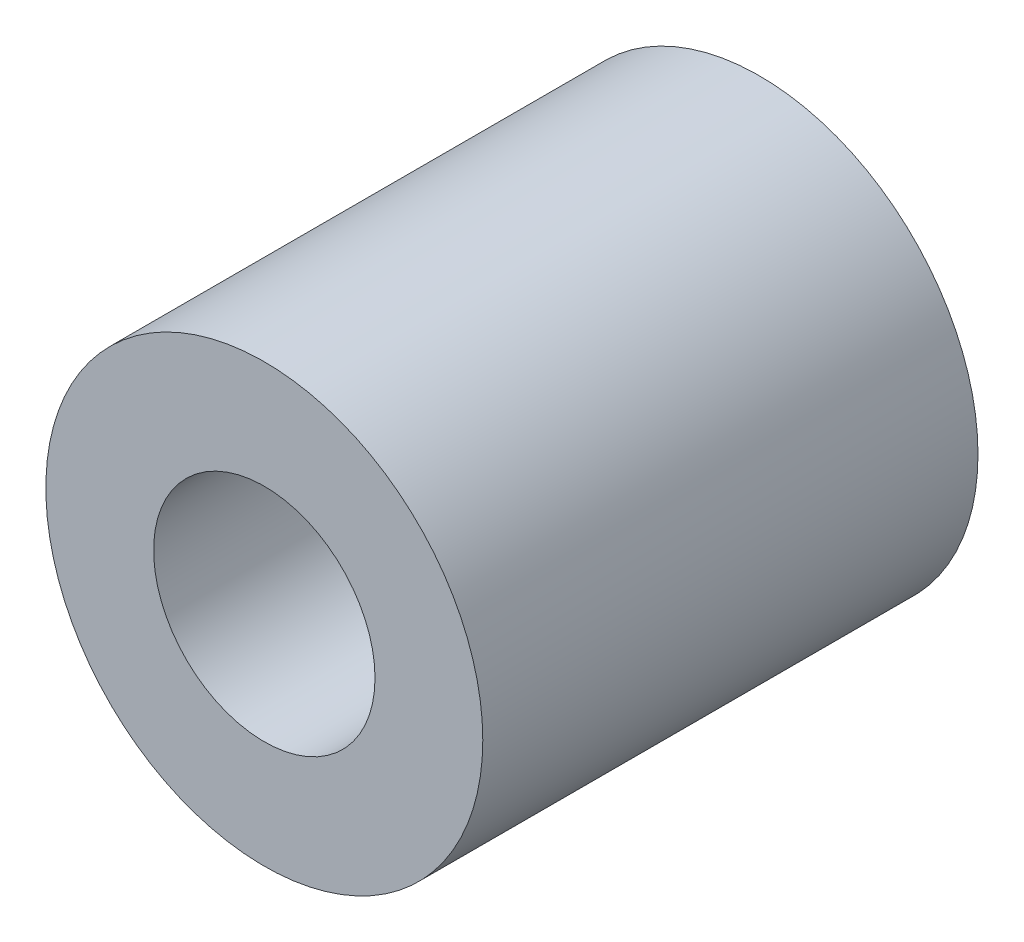
ISO-10303-21;
HEADER;
FILE_DESCRIPTION(('STEP AP214'),'2;1');
FILE_NAME('part.step','',(''),(''),'','','');
FILE_SCHEMA(('AUTOMOTIVE_DESIGN { 1 0 10303 214 1 1 1 1 }'));
ENDSEC;
DATA;
#1=APPLICATION_CONTEXT('core data for automotive mechanical design processes');
#2=APPLICATION_PROTOCOL_DEFINITION('international standard','automotive_design',2000,#1);
#3=PRODUCT_CONTEXT('',#1,'mechanical');
#4=PRODUCT('Part','Part','',(#3));
#5=PRODUCT_RELATED_PRODUCT_CATEGORY('part','',(#4));
#6=PRODUCT_DEFINITION_FORMATION('','',#4);
#7=PRODUCT_DEFINITION_CONTEXT('part definition',#1,'design');
#8=PRODUCT_DEFINITION('design','',#6,#7);
#9=PRODUCT_DEFINITION_SHAPE('','',#8);
#10=(LENGTH_UNIT() NAMED_UNIT(*) SI_UNIT(.MILLI.,.METRE.));
#11=(NAMED_UNIT(*) PLANE_ANGLE_UNIT() SI_UNIT($,.RADIAN.));
#12=(NAMED_UNIT(*) SI_UNIT($,.STERADIAN.) SOLID_ANGLE_UNIT());
#13=UNCERTAINTY_MEASURE_WITH_UNIT(LENGTH_MEASURE(1.E-05),#10,'distance_accuracy_value','');
#14=(GEOMETRIC_REPRESENTATION_CONTEXT(3) GLOBAL_UNCERTAINTY_ASSIGNED_CONTEXT((#13)) GLOBAL_UNIT_ASSIGNED_CONTEXT((#10,
#11,#12)) REPRESENTATION_CONTEXT('',''));
#15=CARTESIAN_POINT('',(0.,0.,0.));
#16=DIRECTION('',(0.,0.,1.));
#17=DIRECTION('',(1.,0.,0.));
#18=AXIS2_PLACEMENT_3D('',#15,#16,#17);
#19=CARTESIAN_POINT('',(0.,0.,21.59));
#20=DIRECTION('',(0.,0.,1.));
#21=DIRECTION('',(1.,0.,0.));
#22=AXIS2_PLACEMENT_3D('',#19,#20,#21);
#23=PLANE('',#22);
#24=CARTESIAN_POINT('',(0.,0.,21.59));
#25=DIRECTION('',(0.,0.,1.));
#26=DIRECTION('',(1.,0.,0.));
#27=AXIS2_PLACEMENT_3D('',#24,#25,#26);
#28=CIRCLE('',#27,9.525);
#29=CARTESIAN_POINT('',(9.525,0.,21.59));
#30=VERTEX_POINT('',#29);
#31=EDGE_CURVE('E10',#30,#30,#28,.T.);
#32=ORIENTED_EDGE('',*,*,#31,.T.);
#33=EDGE_LOOP('',(#32));
#34=FACE_BOUND('',#33,.T.);
#35=CARTESIAN_POINT('',(0.,0.,21.59));
#36=DIRECTION('',(0.,0.,1.));
#37=DIRECTION('',(1.,0.,0.));
#38=AXIS2_PLACEMENT_3D('',#35,#36,#37);
#39=CIRCLE('',#38,4.826);
#40=CARTESIAN_POINT('',(4.826,0.,21.59));
#41=VERTEX_POINT('',#40);
#42=EDGE_CURVE('E41',#41,#41,#39,.T.);
#43=ORIENTED_EDGE('',*,*,#42,.F.);
#44=EDGE_LOOP('',(#43));
#45=FACE_BOUND('',#44,.T.);
#46=ADVANCED_FACE('F30',(#34,#45),#23,.T.);
#47=CARTESIAN_POINT('',(0.,0.,0.));
#48=DIRECTION('',(0.,0.,1.));
#49=DIRECTION('',(1.,0.,0.));
#50=AXIS2_PLACEMENT_3D('',#47,#48,#49);
#51=PLANE('',#50);
#52=CARTESIAN_POINT('',(0.,0.,0.));
#53=DIRECTION('',(0.,0.,1.));
#54=DIRECTION('',(1.,0.,0.));
#55=AXIS2_PLACEMENT_3D('',#52,#53,#54);
#56=CIRCLE('',#55,9.525);
#57=CARTESIAN_POINT('',(9.525,0.,0.));
#58=VERTEX_POINT('',#57);
#59=EDGE_CURVE('E34',#58,#58,#56,.T.);
#60=ORIENTED_EDGE('',*,*,#59,.F.);
#61=EDGE_LOOP('',(#60));
#62=FACE_BOUND('',#61,.T.);
#63=CARTESIAN_POINT('',(0.,0.,0.));
#64=DIRECTION('',(0.,0.,1.));
#65=DIRECTION('',(1.,0.,0.));
#66=AXIS2_PLACEMENT_3D('',#63,#64,#65);
#67=CIRCLE('',#66,4.826);
#68=CARTESIAN_POINT('',(4.826,0.,0.));
#69=VERTEX_POINT('',#68);
#70=EDGE_CURVE('E43',#69,#69,#67,.T.);
#71=ORIENTED_EDGE('',*,*,#70,.T.);
#72=EDGE_LOOP('',(#71));
#73=FACE_BOUND('',#72,.T.);
#74=ADVANCED_FACE('F53',(#62,#73),#51,.F.);
#75=CARTESIAN_POINT('',(0.,0.,21.59));
#76=DIRECTION('',(0.,0.,-1.));
#77=DIRECTION('',(-1.,0.,0.));
#78=AXIS2_PLACEMENT_3D('',#75,#76,#77);
#79=CYLINDRICAL_SURFACE('',#78,9.525);
#80=ORIENTED_EDGE('',*,*,#31,.F.);
#81=EDGE_LOOP('',(#80));
#82=FACE_BOUND('',#81,.T.);
#83=ORIENTED_EDGE('',*,*,#59,.T.);
#84=EDGE_LOOP('',(#83));
#85=FACE_BOUND('',#84,.T.);
#86=ADVANCED_FACE('F32',(#82,#85),#79,.T.);
#87=CARTESIAN_POINT('',(0.,0.,21.59));
#88=DIRECTION('',(0.,0.,-1.));
#89=DIRECTION('',(-1.,0.,0.));
#90=AXIS2_PLACEMENT_3D('',#87,#88,#89);
#91=CYLINDRICAL_SURFACE('',#90,4.826);
#92=ORIENTED_EDGE('',*,*,#42,.T.);
#93=EDGE_LOOP('',(#92));
#94=FACE_BOUND('',#93,.T.);
#95=ORIENTED_EDGE('',*,*,#70,.F.);
#96=EDGE_LOOP('',(#95));
#97=FACE_BOUND('',#96,.T.);
#98=ADVANCED_FACE('F49',(#94,#97),#91,.F.);
#99=CLOSED_SHELL('',(#46,#74,#86,#98));
#100=MANIFOLD_SOLID_BREP('B2',#99);
#101=ADVANCED_BREP_SHAPE_REPRESENTATION('',(#18,#100),#14);
#102=SHAPE_DEFINITION_REPRESENTATION(#9,#101);
ENDSEC;
END-ISO-10303-21;
